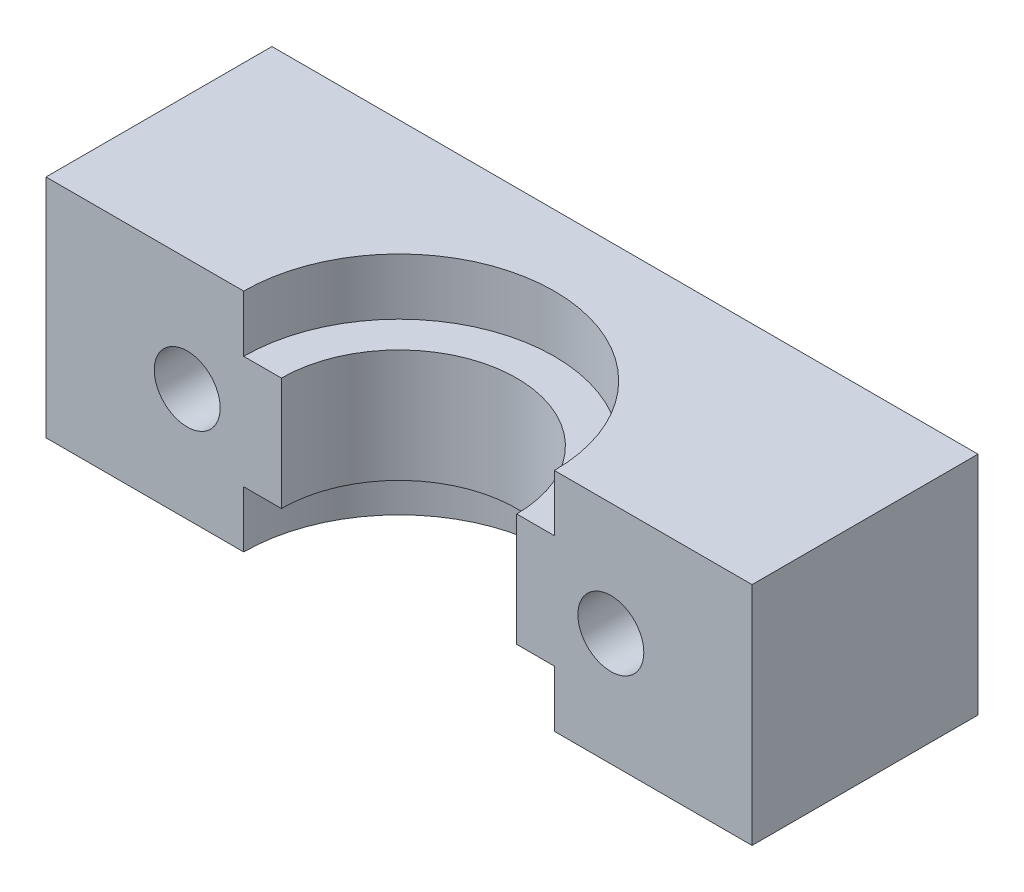
ISO-10303-21;
HEADER;
FILE_DESCRIPTION(('STEP AP214'),'2;1');
FILE_NAME('part.step','',(''),(''),'','','');
FILE_SCHEMA(('AUTOMOTIVE_DESIGN { 1 0 10303 214 1 1 1 1 }'));
ENDSEC;
DATA;
#1=APPLICATION_CONTEXT('core data for automotive mechanical design processes');
#2=APPLICATION_PROTOCOL_DEFINITION('international standard','automotive_design',2000,#1);
#3=PRODUCT_CONTEXT('',#1,'mechanical');
#4=PRODUCT('Part','Part','',(#3));
#5=PRODUCT_RELATED_PRODUCT_CATEGORY('part','',(#4));
#6=PRODUCT_DEFINITION_FORMATION('','',#4);
#7=PRODUCT_DEFINITION_CONTEXT('part definition',#1,'design');
#8=PRODUCT_DEFINITION('design','',#6,#7);
#9=PRODUCT_DEFINITION_SHAPE('','',#8);
#10=(LENGTH_UNIT() NAMED_UNIT(*) SI_UNIT(.MILLI.,.METRE.));
#11=(NAMED_UNIT(*) PLANE_ANGLE_UNIT() SI_UNIT($,.RADIAN.));
#12=(NAMED_UNIT(*) SI_UNIT($,.STERADIAN.) SOLID_ANGLE_UNIT());
#13=UNCERTAINTY_MEASURE_WITH_UNIT(LENGTH_MEASURE(1.E-05),#10,'distance_accuracy_value','');
#14=(GEOMETRIC_REPRESENTATION_CONTEXT(3) GLOBAL_UNCERTAINTY_ASSIGNED_CONTEXT((#13)) GLOBAL_UNIT_ASSIGNED_CONTEXT((#10,
#11,#12)) REPRESENTATION_CONTEXT('',''));
#15=CARTESIAN_POINT('',(0.,0.,0.));
#16=DIRECTION('',(0.,0.,1.));
#17=DIRECTION('',(1.,0.,0.));
#18=AXIS2_PLACEMENT_3D('',#15,#16,#17);
#19=CARTESIAN_POINT('',(-11.25,0.,-12.001));
#20=DIRECTION('',(0.,0.,1.));
#21=DIRECTION('',(1.,0.,0.));
#22=AXIS2_PLACEMENT_3D('',#19,#20,#21);
#23=CYLINDRICAL_SURFACE('',#22,1.75);
#24=CARTESIAN_POINT('',(-11.25,0.,0.));
#25=DIRECTION('',(0.,0.,1.));
#26=DIRECTION('',(1.,0.,0.));
#27=AXIS2_PLACEMENT_3D('',#24,#25,#26);
#28=CIRCLE('',#27,1.75);
#29=CARTESIAN_POINT('',(-9.5,0.,0.));
#30=VERTEX_POINT('',#29);
#31=EDGE_CURVE('E135',#30,#30,#28,.T.);
#32=ORIENTED_EDGE('',*,*,#31,.T.);
#33=EDGE_LOOP('',(#32));
#34=FACE_BOUND('',#33,.T.);
#35=CARTESIAN_POINT('',(-11.25,0.,-9.));
#36=DIRECTION('',(0.,0.,-1.));
#37=DIRECTION('',(-1.,0.,0.));
#38=AXIS2_PLACEMENT_3D('',#35,#36,#37);
#39=CIRCLE('',#38,1.75);
#40=CARTESIAN_POINT('',(-13.,0.,-9.));
#41=VERTEX_POINT('',#40);
#42=EDGE_CURVE('E198',#41,#41,#39,.F.);
#43=ORIENTED_EDGE('',*,*,#42,.F.);
#44=EDGE_LOOP('',(#43));
#45=FACE_BOUND('',#44,.T.);
#46=ADVANCED_FACE('F35',(#34,#45),#23,.F.);
#47=CARTESIAN_POINT('',(0.,6.,0.));
#48=DIRECTION('',(0.,-1.,0.));
#49=DIRECTION('',(0.,0.,-1.));
#50=AXIS2_PLACEMENT_3D('',#47,#48,#49);
#51=CYLINDRICAL_SURFACE('',#50,6.25);
#52=CARTESIAN_POINT('',(0.,-3.,0.));
#53=DIRECTION('',(0.,-1.,0.));
#54=DIRECTION('',(0.,0.,-1.));
#55=AXIS2_PLACEMENT_3D('',#52,#53,#54);
#56=CIRCLE('',#55,6.25);
#57=CARTESIAN_POINT('',(-6.25,-3.,0.));
#58=VERTEX_POINT('',#57);
#59=CARTESIAN_POINT('',(6.25,-3.,0.));
#60=VERTEX_POINT('',#59);
#61=EDGE_CURVE('E121',#58,#60,#56,.T.);
#62=ORIENTED_EDGE('',*,*,#61,.T.);
#63=DIRECTION('',(0.,-1.,0.));
#64=VECTOR('',#63,1.);
#65=CARTESIAN_POINT('',(6.25,6.,0.));
#66=LINE('',#65,#64);
#67=CARTESIAN_POINT('',(6.25,3.,0.));
#68=VERTEX_POINT('',#67);
#69=EDGE_CURVE('E11',#68,#60,#66,.T.);
#70=ORIENTED_EDGE('',*,*,#69,.F.);
#71=CARTESIAN_POINT('',(0.,3.,0.));
#72=DIRECTION('',(0.,1.,0.));
#73=DIRECTION('',(0.,0.,1.));
#74=AXIS2_PLACEMENT_3D('',#71,#72,#73);
#75=CIRCLE('',#74,6.25);
#76=CARTESIAN_POINT('',(-6.25,3.,0.));
#77=VERTEX_POINT('',#76);
#78=EDGE_CURVE('E158',#68,#77,#75,.T.);
#79=ORIENTED_EDGE('',*,*,#78,.T.);
#80=DIRECTION('',(0.,-1.,0.));
#81=VECTOR('',#80,1.);
#82=CARTESIAN_POINT('',(-6.25,6.,0.));
#83=LINE('',#82,#81);
#84=EDGE_CURVE('E178',#77,#58,#83,.T.);
#85=ORIENTED_EDGE('',*,*,#84,.T.);
#86=EDGE_LOOP('',(#62,#70,#79,#85));
#87=FACE_BOUND('',#86,.T.);
#88=ADVANCED_FACE('F37',(#87),#51,.F.);
#89=CARTESIAN_POINT('',(6.25,6.,0.));
#90=DIRECTION('',(0.,0.,-1.));
#91=DIRECTION('',(-1.,0.,0.));
#92=AXIS2_PLACEMENT_3D('',#89,#90,#91);
#93=PLANE('',#92);
#94=CARTESIAN_POINT('',(11.25,0.,0.));
#95=DIRECTION('',(0.,0.,1.));
#96=DIRECTION('',(-1.,0.,0.));
#97=AXIS2_PLACEMENT_3D('',#94,#95,#96);
#98=CIRCLE('',#97,1.75);
#99=CARTESIAN_POINT('',(9.5,0.,0.));
#100=VERTEX_POINT('',#99);
#101=EDGE_CURVE('E139',#100,#100,#98,.T.);
#102=ORIENTED_EDGE('',*,*,#101,.F.);
#103=EDGE_LOOP('',(#102));
#104=FACE_BOUND('',#103,.T.);
#105=DIRECTION('',(1.,0.,0.));
#106=VECTOR('',#105,1.);
#107=CARTESIAN_POINT('',(0.,-3.,0.));
#108=LINE('',#107,#106);
#109=CARTESIAN_POINT('',(8.25,-3.,0.));
#110=VERTEX_POINT('',#109);
#111=EDGE_CURVE('E144',#60,#110,#108,.T.);
#112=ORIENTED_EDGE('',*,*,#111,.T.);
#113=DIRECTION('',(0.,1.,0.));
#114=VECTOR('',#113,1.);
#115=CARTESIAN_POINT('',(8.25,-6.001,0.));
#116=LINE('',#115,#114);
#117=CARTESIAN_POINT('',(8.25,-6.,0.));
#118=VERTEX_POINT('',#117);
#119=EDGE_CURVE('E128',#118,#110,#116,.T.);
#120=ORIENTED_EDGE('',*,*,#119,.F.);
#121=DIRECTION('',(1.,0.,0.));
#122=VECTOR('',#121,1.);
#123=CARTESIAN_POINT('',(6.25,-6.,0.));
#124=LINE('',#123,#122);
#125=CARTESIAN_POINT('',(18.75,-6.,0.));
#126=VERTEX_POINT('',#125);
#127=EDGE_CURVE('E166',#118,#126,#124,.T.);
#128=ORIENTED_EDGE('',*,*,#127,.T.);
#129=DIRECTION('',(0.,-1.,0.));
#130=VECTOR('',#129,1.);
#131=CARTESIAN_POINT('',(18.75,6.,0.));
#132=LINE('',#131,#130);
#133=CARTESIAN_POINT('',(18.75,6.,0.));
#134=VERTEX_POINT('',#133);
#135=EDGE_CURVE('E44',#134,#126,#132,.T.);
#136=ORIENTED_EDGE('',*,*,#135,.F.);
#137=DIRECTION('',(1.,0.,0.));
#138=VECTOR('',#137,1.);
#139=CARTESIAN_POINT('',(6.25,6.,0.));
#140=LINE('',#139,#138);
#141=CARTESIAN_POINT('',(8.25,6.,0.));
#142=VERTEX_POINT('',#141);
#143=EDGE_CURVE('E167',#142,#134,#140,.T.);
#144=ORIENTED_EDGE('',*,*,#143,.F.);
#145=DIRECTION('',(0.,-1.,0.));
#146=VECTOR('',#145,1.);
#147=CARTESIAN_POINT('',(8.25,6.001,0.));
#148=LINE('',#147,#146);
#149=CARTESIAN_POINT('',(8.25,3.,0.));
#150=VERTEX_POINT('',#149);
#151=EDGE_CURVE('E60',#142,#150,#148,.T.);
#152=ORIENTED_EDGE('',*,*,#151,.T.);
#153=DIRECTION('',(-1.,0.,0.));
#154=VECTOR('',#153,1.);
#155=CARTESIAN_POINT('',(0.,3.,0.));
#156=LINE('',#155,#154);
#157=EDGE_CURVE('E161',#150,#68,#156,.T.);
#158=ORIENTED_EDGE('',*,*,#157,.T.);
#159=ORIENTED_EDGE('',*,*,#69,.T.);
#160=EDGE_LOOP('',(#112,#120,#128,#136,#144,#152,#158,#159));
#161=FACE_BOUND('',#160,.T.);
#162=ADVANCED_FACE('F216',(#104,#161),#93,.F.);
#163=CARTESIAN_POINT('',(-6.25,6.,0.));
#164=DIRECTION('',(0.,0.,-1.));
#165=DIRECTION('',(-1.,0.,0.));
#166=AXIS2_PLACEMENT_3D('',#163,#164,#165);
#167=PLANE('',#166);
#168=ORIENTED_EDGE('',*,*,#31,.F.);
#169=EDGE_LOOP('',(#168));
#170=FACE_BOUND('',#169,.T.);
#171=DIRECTION('',(1.,0.,0.));
#172=VECTOR('',#171,1.);
#173=CARTESIAN_POINT('',(-6.25,-6.,0.));
#174=LINE('',#173,#172);
#175=CARTESIAN_POINT('',(-18.75,-6.,0.));
#176=VERTEX_POINT('',#175);
#177=CARTESIAN_POINT('',(-8.25,-6.,0.));
#178=VERTEX_POINT('',#177);
#179=EDGE_CURVE('E134',#176,#178,#174,.T.);
#180=ORIENTED_EDGE('',*,*,#179,.T.);
#181=DIRECTION('',(0.,1.,0.));
#182=VECTOR('',#181,1.);
#183=CARTESIAN_POINT('',(-8.25,-6.001,0.));
#184=LINE('',#183,#182);
#185=CARTESIAN_POINT('',(-8.25,-3.,0.));
#186=VERTEX_POINT('',#185);
#187=EDGE_CURVE('E52',#186,#178,#184,.F.);
#188=ORIENTED_EDGE('',*,*,#187,.F.);
#189=DIRECTION('',(1.,0.,0.));
#190=VECTOR('',#189,1.);
#191=CARTESIAN_POINT('',(0.,-3.,0.));
#192=LINE('',#191,#190);
#193=EDGE_CURVE('E116',#186,#58,#192,.T.);
#194=ORIENTED_EDGE('',*,*,#193,.T.);
#195=ORIENTED_EDGE('',*,*,#84,.F.);
#196=DIRECTION('',(-1.,0.,0.));
#197=VECTOR('',#196,1.);
#198=CARTESIAN_POINT('',(0.,3.,0.));
#199=LINE('',#198,#197);
#200=CARTESIAN_POINT('',(-8.25,3.,0.));
#201=VERTEX_POINT('',#200);
#202=EDGE_CURVE('E155',#77,#201,#199,.T.);
#203=ORIENTED_EDGE('',*,*,#202,.T.);
#204=DIRECTION('',(0.,-1.,0.));
#205=VECTOR('',#204,1.);
#206=CARTESIAN_POINT('',(-8.25,6.001,0.));
#207=LINE('',#206,#205);
#208=CARTESIAN_POINT('',(-8.25,6.,0.));
#209=VERTEX_POINT('',#208);
#210=EDGE_CURVE('E148',#201,#209,#207,.F.);
#211=ORIENTED_EDGE('',*,*,#210,.T.);
#212=DIRECTION('',(1.,0.,0.));
#213=VECTOR('',#212,1.);
#214=CARTESIAN_POINT('',(-6.25,6.,0.));
#215=LINE('',#214,#213);
#216=CARTESIAN_POINT('',(-18.75,6.,0.));
#217=VERTEX_POINT('',#216);
#218=EDGE_CURVE('E175',#217,#209,#215,.T.);
#219=ORIENTED_EDGE('',*,*,#218,.F.);
#220=DIRECTION('',(0.,-1.,0.));
#221=VECTOR('',#220,1.);
#222=CARTESIAN_POINT('',(-18.75,6.,0.));
#223=LINE('',#222,#221);
#224=EDGE_CURVE('E188',#217,#176,#223,.T.);
#225=ORIENTED_EDGE('',*,*,#224,.T.);
#226=EDGE_LOOP('',(#180,#188,#194,#195,#203,#211,#219,#225));
#227=FACE_BOUND('',#226,.T.);
#228=ADVANCED_FACE('F131',(#170,#227),#167,.F.);
#229=CARTESIAN_POINT('',(0.,6.,0.));
#230=DIRECTION('',(0.,1.,0.));
#231=DIRECTION('',(0.,0.,1.));
#232=AXIS2_PLACEMENT_3D('',#229,#230,#231);
#233=PLANE('',#232);
#234=ORIENTED_EDGE('',*,*,#218,.T.);
#235=CARTESIAN_POINT('',(0.,6.,0.));
#236=DIRECTION('',(0.,1.,0.));
#237=DIRECTION('',(0.,0.,1.));
#238=AXIS2_PLACEMENT_3D('',#235,#236,#237);
#239=CIRCLE('',#238,8.25);
#240=EDGE_CURVE('E164',#142,#209,#239,.T.);
#241=ORIENTED_EDGE('',*,*,#240,.F.);
#242=ORIENTED_EDGE('',*,*,#143,.T.);
#243=DIRECTION('',(0.,0.,-1.));
#244=VECTOR('',#243,1.);
#245=CARTESIAN_POINT('',(18.75,6.,0.));
#246=LINE('',#245,#244);
#247=CARTESIAN_POINT('',(18.75,6.,-12.));
#248=VERTEX_POINT('',#247);
#249=EDGE_CURVE('E169',#134,#248,#246,.T.);
#250=ORIENTED_EDGE('',*,*,#249,.T.);
#251=DIRECTION('',(-1.,0.,0.));
#252=VECTOR('',#251,1.);
#253=CARTESIAN_POINT('',(-18.75,6.,-12.));
#254=LINE('',#253,#252);
#255=CARTESIAN_POINT('',(-18.75,6.,-12.));
#256=VERTEX_POINT('',#255);
#257=EDGE_CURVE('E171',#248,#256,#254,.T.);
#258=ORIENTED_EDGE('',*,*,#257,.T.);
#259=DIRECTION('',(0.,0.,1.));
#260=VECTOR('',#259,1.);
#261=CARTESIAN_POINT('',(-18.75,6.,0.));
#262=LINE('',#261,#260);
#263=EDGE_CURVE('E173',#256,#217,#262,.T.);
#264=ORIENTED_EDGE('',*,*,#263,.T.);
#265=EDGE_LOOP('',(#234,#241,#242,#250,#258,#264));
#266=FACE_BOUND('',#265,.T.);
#267=ADVANCED_FACE('F230',(#266),#233,.T.);
#268=CARTESIAN_POINT('',(18.75,6.,0.));
#269=DIRECTION('',(-1.,0.,0.));
#270=DIRECTION('',(0.,0.,1.));
#271=AXIS2_PLACEMENT_3D('',#268,#269,#270);
#272=PLANE('',#271);
#273=DIRECTION('',(0.,0.,-1.));
#274=VECTOR('',#273,1.);
#275=CARTESIAN_POINT('',(18.75,-6.,0.));
#276=LINE('',#275,#274);
#277=CARTESIAN_POINT('',(18.75,-6.,-12.));
#278=VERTEX_POINT('',#277);
#279=EDGE_CURVE('E180',#126,#278,#276,.T.);
#280=ORIENTED_EDGE('',*,*,#279,.T.);
#281=DIRECTION('',(0.,-1.,0.));
#282=VECTOR('',#281,1.);
#283=CARTESIAN_POINT('',(18.75,6.,-12.));
#284=LINE('',#283,#282);
#285=EDGE_CURVE('E193',#248,#278,#284,.T.);
#286=ORIENTED_EDGE('',*,*,#285,.F.);
#287=ORIENTED_EDGE('',*,*,#249,.F.);
#288=ORIENTED_EDGE('',*,*,#135,.T.);
#289=EDGE_LOOP('',(#280,#286,#287,#288));
#290=FACE_BOUND('',#289,.T.);
#291=ADVANCED_FACE('F241',(#290),#272,.F.);
#292=CARTESIAN_POINT('',(-18.75,6.,-12.));
#293=DIRECTION('',(0.,0.,1.));
#294=DIRECTION('',(1.,0.,0.));
#295=AXIS2_PLACEMENT_3D('',#292,#293,#294);
#296=PLANE('',#295);
#297=CARTESIAN_POINT('',(-11.25,0.,-12.));
#298=DIRECTION('',(0.,0.,1.));
#299=DIRECTION('',(1.,0.,0.));
#300=AXIS2_PLACEMENT_3D('',#297,#298,#299);
#301=CIRCLE('',#300,3.);
#302=CARTESIAN_POINT('',(-8.25,0.,-12.));
#303=VERTEX_POINT('',#302);
#304=EDGE_CURVE('E39',#303,#303,#301,.F.);
#305=ORIENTED_EDGE('',*,*,#304,.F.);
#306=EDGE_LOOP('',(#305));
#307=FACE_BOUND('',#306,.T.);
#308=CARTESIAN_POINT('',(11.25,0.,-12.));
#309=DIRECTION('',(0.,0.,1.));
#310=DIRECTION('',(1.,0.,0.));
#311=AXIS2_PLACEMENT_3D('',#308,#309,#310);
#312=CIRCLE('',#311,3.);
#313=CARTESIAN_POINT('',(14.25,0.,-12.));
#314=VERTEX_POINT('',#313);
#315=EDGE_CURVE('E204',#314,#314,#312,.F.);
#316=ORIENTED_EDGE('',*,*,#315,.F.);
#317=EDGE_LOOP('',(#316));
#318=FACE_BOUND('',#317,.T.);
#319=DIRECTION('',(-1.,0.,0.));
#320=VECTOR('',#319,1.);
#321=CARTESIAN_POINT('',(-18.75,-6.,-12.));
#322=LINE('',#321,#320);
#323=CARTESIAN_POINT('',(-18.75,-6.,-12.));
#324=VERTEX_POINT('',#323);
#325=EDGE_CURVE('E182',#278,#324,#322,.T.);
#326=ORIENTED_EDGE('',*,*,#325,.T.);
#327=DIRECTION('',(0.,-1.,0.));
#328=VECTOR('',#327,1.);
#329=CARTESIAN_POINT('',(-18.75,6.,-12.));
#330=LINE('',#329,#328);
#331=EDGE_CURVE('E190',#256,#324,#330,.T.);
#332=ORIENTED_EDGE('',*,*,#331,.F.);
#333=ORIENTED_EDGE('',*,*,#257,.F.);
#334=ORIENTED_EDGE('',*,*,#285,.T.);
#335=EDGE_LOOP('',(#326,#332,#333,#334));
#336=FACE_BOUND('',#335,.T.);
#337=ADVANCED_FACE('F245',(#307,#318,#336),#296,.F.);
#338=CARTESIAN_POINT('',(-18.75,6.,0.));
#339=DIRECTION('',(1.,0.,0.));
#340=DIRECTION('',(0.,0.,-1.));
#341=AXIS2_PLACEMENT_3D('',#338,#339,#340);
#342=PLANE('',#341);
#343=DIRECTION('',(0.,0.,1.));
#344=VECTOR('',#343,1.);
#345=CARTESIAN_POINT('',(-18.75,-6.,0.));
#346=LINE('',#345,#344);
#347=EDGE_CURVE('E184',#324,#176,#346,.T.);
#348=ORIENTED_EDGE('',*,*,#347,.T.);
#349=ORIENTED_EDGE('',*,*,#224,.F.);
#350=ORIENTED_EDGE('',*,*,#263,.F.);
#351=ORIENTED_EDGE('',*,*,#331,.T.);
#352=EDGE_LOOP('',(#348,#349,#350,#351));
#353=FACE_BOUND('',#352,.T.);
#354=ADVANCED_FACE('F246',(#353),#342,.F.);
#355=CARTESIAN_POINT('',(0.,-6.,0.));
#356=DIRECTION('',(0.,1.,0.));
#357=DIRECTION('',(0.,0.,1.));
#358=AXIS2_PLACEMENT_3D('',#355,#356,#357);
#359=PLANE('',#358);
#360=ORIENTED_EDGE('',*,*,#127,.F.);
#361=CARTESIAN_POINT('',(0.,-6.,0.));
#362=DIRECTION('',(0.,1.,0.));
#363=DIRECTION('',(0.,0.,1.));
#364=AXIS2_PLACEMENT_3D('',#361,#362,#363);
#365=CIRCLE('',#364,8.25);
#366=EDGE_CURVE('E146',#178,#118,#365,.F.);
#367=ORIENTED_EDGE('',*,*,#366,.F.);
#368=ORIENTED_EDGE('',*,*,#179,.F.);
#369=ORIENTED_EDGE('',*,*,#347,.F.);
#370=ORIENTED_EDGE('',*,*,#325,.F.);
#371=ORIENTED_EDGE('',*,*,#279,.F.);
#372=EDGE_LOOP('',(#360,#367,#368,#369,#370,#371));
#373=FACE_BOUND('',#372,.T.);
#374=ADVANCED_FACE('F237',(#373),#359,.F.);
#375=CARTESIAN_POINT('',(0.,6.001,0.));
#376=DIRECTION('',(0.,-1.,0.));
#377=DIRECTION('',(0.,0.,-1.));
#378=AXIS2_PLACEMENT_3D('',#375,#376,#377);
#379=CYLINDRICAL_SURFACE('',#378,8.25);
#380=ORIENTED_EDGE('',*,*,#240,.T.);
#381=ORIENTED_EDGE('',*,*,#210,.F.);
#382=CARTESIAN_POINT('',(0.,3.,0.));
#383=DIRECTION('',(0.,1.,0.));
#384=DIRECTION('',(0.,0.,1.));
#385=AXIS2_PLACEMENT_3D('',#382,#383,#384);
#386=CIRCLE('',#385,8.25);
#387=EDGE_CURVE('E152',#150,#201,#386,.T.);
#388=ORIENTED_EDGE('',*,*,#387,.F.);
#389=ORIENTED_EDGE('',*,*,#151,.F.);
#390=EDGE_LOOP('',(#380,#381,#388,#389));
#391=FACE_BOUND('',#390,.T.);
#392=ADVANCED_FACE('F225',(#391),#379,.F.);
#393=CARTESIAN_POINT('',(0.,3.,0.));
#394=DIRECTION('',(0.,1.,0.));
#395=DIRECTION('',(0.,0.,1.));
#396=AXIS2_PLACEMENT_3D('',#393,#394,#395);
#397=PLANE('',#396);
#398=ORIENTED_EDGE('',*,*,#387,.T.);
#399=ORIENTED_EDGE('',*,*,#202,.F.);
#400=ORIENTED_EDGE('',*,*,#78,.F.);
#401=ORIENTED_EDGE('',*,*,#157,.F.);
#402=EDGE_LOOP('',(#398,#399,#400,#401));
#403=FACE_BOUND('',#402,.T.);
#404=ADVANCED_FACE('F224',(#403),#397,.T.);
#405=CARTESIAN_POINT('',(0.,-6.001,0.));
#406=DIRECTION('',(0.,1.,0.));
#407=DIRECTION('',(0.,0.,1.));
#408=AXIS2_PLACEMENT_3D('',#405,#406,#407);
#409=CYLINDRICAL_SURFACE('',#408,8.25);
#410=ORIENTED_EDGE('',*,*,#119,.T.);
#411=CARTESIAN_POINT('',(0.,-3.,0.));
#412=DIRECTION('',(0.,1.,0.));
#413=DIRECTION('',(0.,0.,1.));
#414=AXIS2_PLACEMENT_3D('',#411,#412,#413);
#415=CIRCLE('',#414,8.25);
#416=EDGE_CURVE('E118',#110,#186,#415,.T.);
#417=ORIENTED_EDGE('',*,*,#416,.T.);
#418=ORIENTED_EDGE('',*,*,#187,.T.);
#419=ORIENTED_EDGE('',*,*,#366,.T.);
#420=EDGE_LOOP('',(#410,#417,#418,#419));
#421=FACE_BOUND('',#420,.T.);
#422=ADVANCED_FACE('F126',(#421),#409,.F.);
#423=CARTESIAN_POINT('',(0.,-3.,0.));
#424=DIRECTION('',(0.,-1.,0.));
#425=DIRECTION('',(0.,0.,1.));
#426=AXIS2_PLACEMENT_3D('',#423,#424,#425);
#427=PLANE('',#426);
#428=ORIENTED_EDGE('',*,*,#61,.F.);
#429=ORIENTED_EDGE('',*,*,#193,.F.);
#430=ORIENTED_EDGE('',*,*,#416,.F.);
#431=ORIENTED_EDGE('',*,*,#111,.F.);
#432=EDGE_LOOP('',(#428,#429,#430,#431));
#433=FACE_BOUND('',#432,.T.);
#434=ADVANCED_FACE('F117',(#433),#427,.T.);
#435=CARTESIAN_POINT('',(11.25,0.,-12.001));
#436=DIRECTION('',(0.,0.,1.));
#437=DIRECTION('',(1.,0.,0.));
#438=AXIS2_PLACEMENT_3D('',#435,#436,#437);
#439=CYLINDRICAL_SURFACE('',#438,1.75);
#440=CARTESIAN_POINT('',(11.25,0.,-9.));
#441=DIRECTION('',(0.,0.,1.));
#442=DIRECTION('',(1.,0.,0.));
#443=AXIS2_PLACEMENT_3D('',#440,#441,#442);
#444=CIRCLE('',#443,1.75);
#445=CARTESIAN_POINT('',(13.,0.,-9.));
#446=VERTEX_POINT('',#445);
#447=EDGE_CURVE('E201',#446,#446,#444,.F.);
#448=ORIENTED_EDGE('',*,*,#447,.T.);
#449=EDGE_LOOP('',(#448));
#450=FACE_BOUND('',#449,.T.);
#451=ORIENTED_EDGE('',*,*,#101,.T.);
#452=EDGE_LOOP('',(#451));
#453=FACE_BOUND('',#452,.T.);
#454=ADVANCED_FACE('F214',(#450,#453),#439,.F.);
#455=CARTESIAN_POINT('',(-11.25,0.,-12.000012));
#456=DIRECTION('',(0.,0.,1.));
#457=DIRECTION('',(1.,0.,0.));
#458=AXIS2_PLACEMENT_3D('',#455,#456,#457);
#459=CYLINDRICAL_SURFACE('',#458,3.);
#460=CARTESIAN_POINT('',(-11.25,0.,-9.));
#461=DIRECTION('',(0.,0.,-1.));
#462=DIRECTION('',(-1.,0.,0.));
#463=AXIS2_PLACEMENT_3D('',#460,#461,#462);
#464=CIRCLE('',#463,3.);
#465=CARTESIAN_POINT('',(-14.25,0.,-9.));
#466=VERTEX_POINT('',#465);
#467=EDGE_CURVE('E202',#466,#466,#464,.T.);
#468=ORIENTED_EDGE('',*,*,#467,.F.);
#469=EDGE_LOOP('',(#468));
#470=FACE_BOUND('',#469,.T.);
#471=ORIENTED_EDGE('',*,*,#304,.T.);
#472=EDGE_LOOP('',(#471));
#473=FACE_BOUND('',#472,.T.);
#474=ADVANCED_FACE('F270',(#470,#473),#459,.F.);
#475=CARTESIAN_POINT('',(-11.25,0.,-9.));
#476=DIRECTION('',(0.,0.,-1.));
#477=DIRECTION('',(-1.,0.,0.));
#478=AXIS2_PLACEMENT_3D('',#475,#476,#477);
#479=PLANE('',#478);
#480=ORIENTED_EDGE('',*,*,#467,.T.);
#481=EDGE_LOOP('',(#480));
#482=FACE_BOUND('',#481,.T.);
#483=ORIENTED_EDGE('',*,*,#42,.T.);
#484=EDGE_LOOP('',(#483));
#485=FACE_BOUND('',#484,.T.);
#486=ADVANCED_FACE('F322',(#482,#485),#479,.T.);
#487=CARTESIAN_POINT('',(11.25,0.,-12.000012));
#488=DIRECTION('',(0.,0.,1.));
#489=DIRECTION('',(1.,0.,0.));
#490=AXIS2_PLACEMENT_3D('',#487,#488,#489);
#491=CYLINDRICAL_SURFACE('',#490,3.);
#492=CARTESIAN_POINT('',(11.25,0.,-9.));
#493=DIRECTION('',(0.,0.,-1.));
#494=DIRECTION('',(1.,0.,0.));
#495=AXIS2_PLACEMENT_3D('',#492,#493,#494);
#496=CIRCLE('',#495,3.);
#497=CARTESIAN_POINT('',(14.25,0.,-9.));
#498=VERTEX_POINT('',#497);
#499=EDGE_CURVE('E356',#498,#498,#496,.T.);
#500=ORIENTED_EDGE('',*,*,#499,.F.);
#501=EDGE_LOOP('',(#500));
#502=FACE_BOUND('',#501,.T.);
#503=ORIENTED_EDGE('',*,*,#315,.T.);
#504=EDGE_LOOP('',(#503));
#505=FACE_BOUND('',#504,.T.);
#506=ADVANCED_FACE('F266',(#502,#505),#491,.F.);
#507=CARTESIAN_POINT('',(11.25,0.,-9.));
#508=DIRECTION('',(0.,0.,1.));
#509=DIRECTION('',(1.,0.,0.));
#510=AXIS2_PLACEMENT_3D('',#507,#508,#509);
#511=PLANE('',#510);
#512=ORIENTED_EDGE('',*,*,#499,.T.);
#513=EDGE_LOOP('',(#512));
#514=FACE_BOUND('',#513,.T.);
#515=ORIENTED_EDGE('',*,*,#447,.F.);
#516=EDGE_LOOP('',(#515));
#517=FACE_BOUND('',#516,.T.);
#518=ADVANCED_FACE('F341',(#514,#517),#511,.F.);
#519=CLOSED_SHELL('',(#46,#88,#162,#228,#267,#291,#337,#354,#374,#392,#404,#422,#434,#454,#474,
#486,#506,#518));
#520=MANIFOLD_SOLID_BREP('B2',#519);
#521=ADVANCED_BREP_SHAPE_REPRESENTATION('',(#18,#520),#14);
#522=SHAPE_DEFINITION_REPRESENTATION(#9,#521);
ENDSEC;
END-ISO-10303-21;
